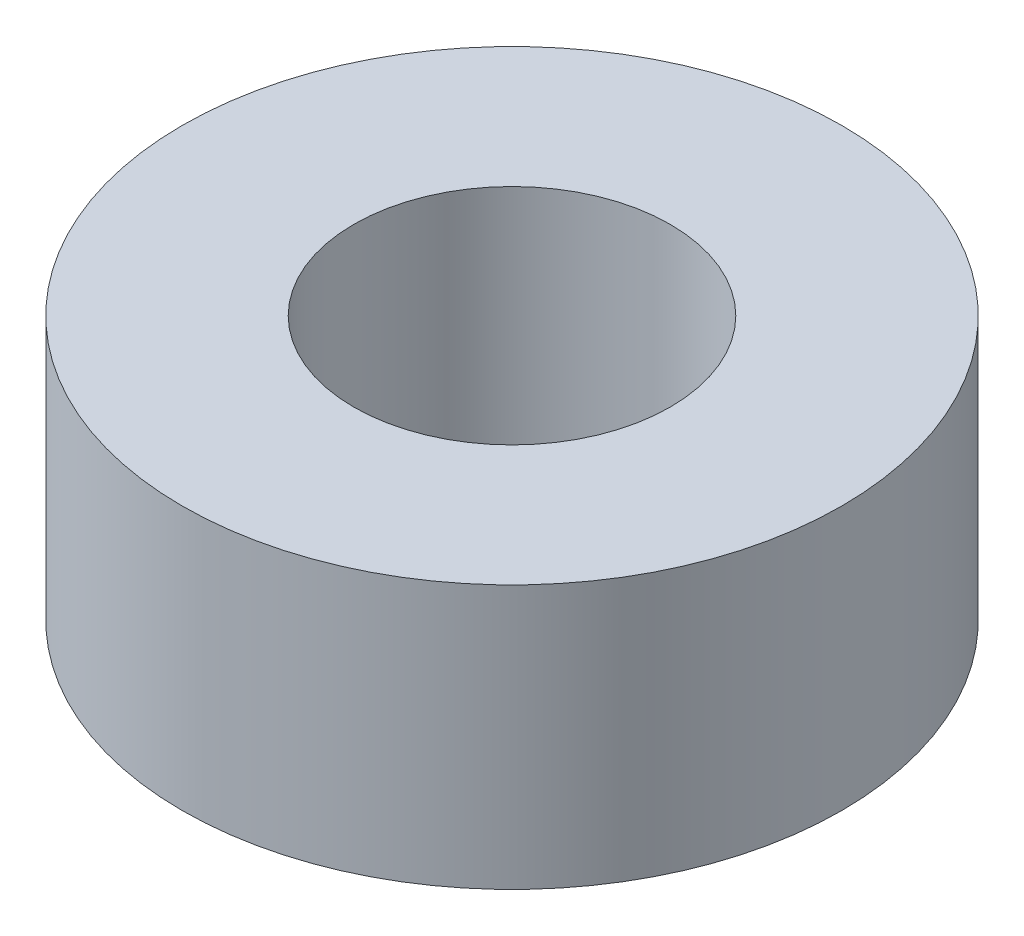
ISO-10303-21;
HEADER;
FILE_DESCRIPTION(('STEP AP214'),'2;1');
FILE_NAME('part.step','',(''),(''),'','','');
FILE_SCHEMA(('AUTOMOTIVE_DESIGN { 1 0 10303 214 1 1 1 1 }'));
ENDSEC;
DATA;
#1=APPLICATION_CONTEXT('core data for automotive mechanical design processes');
#2=APPLICATION_PROTOCOL_DEFINITION('international standard','automotive_design',2000,#1);
#3=PRODUCT_CONTEXT('',#1,'mechanical');
#4=PRODUCT('Part','Part','',(#3));
#5=PRODUCT_RELATED_PRODUCT_CATEGORY('part','',(#4));
#6=PRODUCT_DEFINITION_FORMATION('','',#4);
#7=PRODUCT_DEFINITION_CONTEXT('part definition',#1,'design');
#8=PRODUCT_DEFINITION('design','',#6,#7);
#9=PRODUCT_DEFINITION_SHAPE('','',#8);
#10=(LENGTH_UNIT() NAMED_UNIT(*) SI_UNIT(.MILLI.,.METRE.));
#11=(NAMED_UNIT(*) PLANE_ANGLE_UNIT() SI_UNIT($,.RADIAN.));
#12=(NAMED_UNIT(*) SI_UNIT($,.STERADIAN.) SOLID_ANGLE_UNIT());
#13=UNCERTAINTY_MEASURE_WITH_UNIT(LENGTH_MEASURE(1.E-05),#10,'distance_accuracy_value','');
#14=(GEOMETRIC_REPRESENTATION_CONTEXT(3) GLOBAL_UNCERTAINTY_ASSIGNED_CONTEXT((#13)) GLOBAL_UNIT_ASSIGNED_CONTEXT((#10,
#11,#12)) REPRESENTATION_CONTEXT('',''));
#15=CARTESIAN_POINT('',(0.,0.,0.));
#16=DIRECTION('',(0.,0.,1.));
#17=DIRECTION('',(1.,0.,0.));
#18=AXIS2_PLACEMENT_3D('',#15,#16,#17);
#19=CARTESIAN_POINT('',(0.,4.,0.));
#20=DIRECTION('',(0.,1.,0.));
#21=DIRECTION('',(0.,0.,1.));
#22=AXIS2_PLACEMENT_3D('',#19,#20,#21);
#23=PLANE('',#22);
#24=CARTESIAN_POINT('',(0.,4.,0.));
#25=DIRECTION('',(0.,1.,0.));
#26=DIRECTION('',(0.,0.,1.));
#27=AXIS2_PLACEMENT_3D('',#24,#25,#26);
#28=CIRCLE('',#27,5.);
#29=CARTESIAN_POINT('',(0.,4.,5.));
#30=VERTEX_POINT('',#29);
#31=EDGE_CURVE('E10',#30,#30,#28,.T.);
#32=ORIENTED_EDGE('',*,*,#31,.T.);
#33=EDGE_LOOP('',(#32));
#34=FACE_BOUND('',#33,.T.);
#35=CARTESIAN_POINT('',(0.,4.,0.));
#36=DIRECTION('',(0.,1.,0.));
#37=DIRECTION('',(0.,0.,1.));
#38=AXIS2_PLACEMENT_3D('',#35,#36,#37);
#39=CIRCLE('',#38,2.4);
#40=CARTESIAN_POINT('',(0.,4.,2.4));
#41=VERTEX_POINT('',#40);
#42=EDGE_CURVE('E56',#41,#41,#39,.T.);
#43=ORIENTED_EDGE('',*,*,#42,.F.);
#44=EDGE_LOOP('',(#43));
#45=FACE_BOUND('',#44,.T.);
#46=ADVANCED_FACE('F43',(#34,#45),#23,.T.);
#47=CARTESIAN_POINT('',(0.,0.,0.));
#48=DIRECTION('',(0.,1.,0.));
#49=DIRECTION('',(0.,0.,1.));
#50=AXIS2_PLACEMENT_3D('',#47,#48,#49);
#51=PLANE('',#50);
#52=CARTESIAN_POINT('',(0.,0.,0.));
#53=DIRECTION('',(0.,1.,0.));
#54=DIRECTION('',(0.,0.,1.));
#55=AXIS2_PLACEMENT_3D('',#52,#53,#54);
#56=CIRCLE('',#55,5.);
#57=CARTESIAN_POINT('',(0.,0.,5.));
#58=VERTEX_POINT('',#57);
#59=EDGE_CURVE('E47',#58,#58,#56,.T.);
#60=ORIENTED_EDGE('',*,*,#59,.F.);
#61=EDGE_LOOP('',(#60));
#62=FACE_BOUND('',#61,.T.);
#63=CARTESIAN_POINT('',(0.,0.,0.));
#64=DIRECTION('',(0.,1.,0.));
#65=DIRECTION('',(0.,0.,1.));
#66=AXIS2_PLACEMENT_3D('',#63,#64,#65);
#67=CIRCLE('',#66,2.4);
#68=CARTESIAN_POINT('',(0.,0.,2.4));
#69=VERTEX_POINT('',#68);
#70=EDGE_CURVE('E58',#69,#69,#67,.T.);
#71=ORIENTED_EDGE('',*,*,#70,.T.);
#72=EDGE_LOOP('',(#71));
#73=FACE_BOUND('',#72,.T.);
#74=ADVANCED_FACE('F70',(#62,#73),#51,.F.);
#75=CARTESIAN_POINT('',(0.,4.,0.));
#76=DIRECTION('',(0.,-1.,0.));
#77=DIRECTION('',(0.,0.,-1.));
#78=AXIS2_PLACEMENT_3D('',#75,#76,#77);
#79=CYLINDRICAL_SURFACE('',#78,5.);
#80=ORIENTED_EDGE('',*,*,#31,.F.);
#81=EDGE_LOOP('',(#80));
#82=FACE_BOUND('',#81,.T.);
#83=ORIENTED_EDGE('',*,*,#59,.T.);
#84=EDGE_LOOP('',(#83));
#85=FACE_BOUND('',#84,.T.);
#86=ADVANCED_FACE('F45',(#82,#85),#79,.T.);
#87=CARTESIAN_POINT('',(0.,4.,0.));
#88=DIRECTION('',(0.,-1.,0.));
#89=DIRECTION('',(0.,0.,-1.));
#90=AXIS2_PLACEMENT_3D('',#87,#88,#89);
#91=CYLINDRICAL_SURFACE('',#90,2.4);
#92=ORIENTED_EDGE('',*,*,#42,.T.);
#93=EDGE_LOOP('',(#92));
#94=FACE_BOUND('',#93,.T.);
#95=ORIENTED_EDGE('',*,*,#70,.F.);
#96=EDGE_LOOP('',(#95));
#97=FACE_BOUND('',#96,.T.);
#98=ADVANCED_FACE('F66',(#94,#97),#91,.F.);
#99=CLOSED_SHELL('',(#46,#74,#86,#98));
#100=MANIFOLD_SOLID_BREP('B2',#99);
#101=ADVANCED_BREP_SHAPE_REPRESENTATION('',(#18,#100),#14);
#102=SHAPE_DEFINITION_REPRESENTATION(#9,#101);
ENDSEC;
END-ISO-10303-21;
